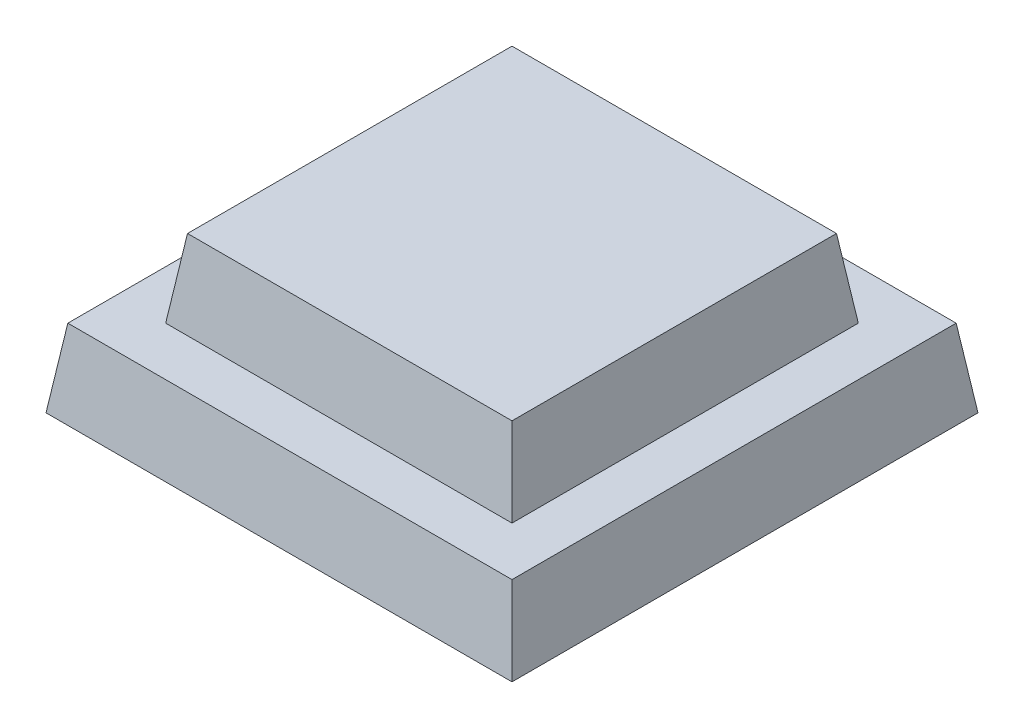
ISO-10303-21;
HEADER;
FILE_DESCRIPTION(('STEP AP214'),'2;1');
FILE_NAME('part.step','',(''),(''),'','','');
FILE_SCHEMA(('AUTOMOTIVE_DESIGN { 1 0 10303 214 1 1 1 1 }'));
ENDSEC;
DATA;
#1=APPLICATION_CONTEXT('core data for automotive mechanical design processes');
#2=APPLICATION_PROTOCOL_DEFINITION('international standard','automotive_design',2000,#1);
#3=PRODUCT_CONTEXT('',#1,'mechanical');
#4=PRODUCT('Part','Part','',(#3));
#5=PRODUCT_RELATED_PRODUCT_CATEGORY('part','',(#4));
#6=PRODUCT_DEFINITION_FORMATION('','',#4);
#7=PRODUCT_DEFINITION_CONTEXT('part definition',#1,'design');
#8=PRODUCT_DEFINITION('design','',#6,#7);
#9=PRODUCT_DEFINITION_SHAPE('','',#8);
#10=(LENGTH_UNIT() NAMED_UNIT(*) SI_UNIT(.MILLI.,.METRE.));
#11=(NAMED_UNIT(*) PLANE_ANGLE_UNIT() SI_UNIT($,.RADIAN.));
#12=(NAMED_UNIT(*) SI_UNIT($,.STERADIAN.) SOLID_ANGLE_UNIT());
#13=UNCERTAINTY_MEASURE_WITH_UNIT(LENGTH_MEASURE(1.E-05),#10,'distance_accuracy_value','');
#14=(GEOMETRIC_REPRESENTATION_CONTEXT(3) GLOBAL_UNCERTAINTY_ASSIGNED_CONTEXT((#13)) GLOBAL_UNIT_ASSIGNED_CONTEXT((#10,
#11,#12)) REPRESENTATION_CONTEXT('',''));
#15=CARTESIAN_POINT('',(0.,0.,0.));
#16=DIRECTION('',(0.,0.,1.));
#17=DIRECTION('',(1.,0.,0.));
#18=AXIS2_PLACEMENT_3D('',#15,#16,#17);
#19=CARTESIAN_POINT('',(0.,3.175,0.));
#20=DIRECTION('',(0.,1.,0.));
#21=DIRECTION('',(0.,0.,1.));
#22=AXIS2_PLACEMENT_3D('',#19,#20,#21);
#23=PLANE('',#22);
#24=DIRECTION('',(0.,0.,1.));
#25=VECTOR('',#24,1.);
#26=CARTESIAN_POINT('',(9.07878284981991,3.175,-9.525));
#27=LINE('',#26,#25);
#28=CARTESIAN_POINT('',(9.07878284981991,3.175,9.0787828498199));
#29=VERTEX_POINT('',#28);
#30=CARTESIAN_POINT('',(9.07878284981991,3.175,-9.0787828498199));
#31=VERTEX_POINT('',#30);
#32=EDGE_CURVE('E147',#29,#31,#27,.F.);
#33=ORIENTED_EDGE('',*,*,#32,.T.);
#34=DIRECTION('',(1.,0.,0.));
#35=VECTOR('',#34,1.);
#36=CARTESIAN_POINT('',(-9.525,3.175,-9.0787828498199));
#37=LINE('',#36,#35);
#38=CARTESIAN_POINT('',(-9.07878284981991,3.175,-9.0787828498199));
#39=VERTEX_POINT('',#38);
#40=EDGE_CURVE('E158',#31,#39,#37,.F.);
#41=ORIENTED_EDGE('',*,*,#40,.T.);
#42=DIRECTION('',(0.,0.,-1.));
#43=VECTOR('',#42,1.);
#44=CARTESIAN_POINT('',(-9.07878284981991,3.175,-9.525));
#45=LINE('',#44,#43);
#46=CARTESIAN_POINT('',(-9.07878284981991,3.175,9.0787828498199));
#47=VERTEX_POINT('',#46);
#48=EDGE_CURVE('E159',#39,#47,#45,.F.);
#49=ORIENTED_EDGE('',*,*,#48,.T.);
#50=DIRECTION('',(-1.,0.,0.));
#51=VECTOR('',#50,1.);
#52=CARTESIAN_POINT('',(-9.525,3.175,9.0787828498199));
#53=LINE('',#52,#51);
#54=EDGE_CURVE('E37',#47,#29,#53,.F.);
#55=ORIENTED_EDGE('',*,*,#54,.T.);
#56=EDGE_LOOP('',(#33,#41,#49,#55));
#57=FACE_BOUND('',#56,.T.);
#58=DIRECTION('',(1.,0.,0.));
#59=VECTOR('',#58,1.);
#60=CARTESIAN_POINT('',(-7.07878284981991,3.175,7.0787828498199));
#61=LINE('',#60,#59);
#62=CARTESIAN_POINT('',(-7.07878284981991,3.175,7.0787828498199));
#63=VERTEX_POINT('',#62);
#64=CARTESIAN_POINT('',(7.07878284981991,3.175,7.0787828498199));
#65=VERTEX_POINT('',#64);
#66=EDGE_CURVE('E105',#63,#65,#61,.T.);
#67=ORIENTED_EDGE('',*,*,#66,.F.);
#68=DIRECTION('',(0.,0.,1.));
#69=VECTOR('',#68,1.);
#70=CARTESIAN_POINT('',(-7.07878284981991,3.175,-7.0787828498199));
#71=LINE('',#70,#69);
#72=CARTESIAN_POINT('',(-7.07878284981991,3.175,-7.0787828498199));
#73=VERTEX_POINT('',#72);
#74=EDGE_CURVE('E116',#73,#63,#71,.T.);
#75=ORIENTED_EDGE('',*,*,#74,.F.);
#76=DIRECTION('',(-1.,0.,0.));
#77=VECTOR('',#76,1.);
#78=CARTESIAN_POINT('',(7.07878284981991,3.175,-7.0787828498199));
#79=LINE('',#78,#77);
#80=CARTESIAN_POINT('',(7.07878284981991,3.175,-7.0787828498199));
#81=VERTEX_POINT('',#80);
#82=EDGE_CURVE('E126',#81,#73,#79,.T.);
#83=ORIENTED_EDGE('',*,*,#82,.F.);
#84=DIRECTION('',(0.,0.,-1.));
#85=VECTOR('',#84,1.);
#86=CARTESIAN_POINT('',(7.07878284981991,3.175,7.0787828498199));
#87=LINE('',#86,#85);
#88=EDGE_CURVE('E124',#65,#81,#87,.T.);
#89=ORIENTED_EDGE('',*,*,#88,.F.);
#90=EDGE_LOOP('',(#67,#75,#83,#89));
#91=FACE_BOUND('',#90,.T.);
#92=ADVANCED_FACE('F33',(#57,#91),#23,.T.);
#93=CARTESIAN_POINT('',(9.525,0.,-9.525));
#94=DIRECTION('',(0.99026806874157,0.139173100960066,0.));
#95=DIRECTION('',(-0.139173100960066,0.99026806874157,0.));
#96=AXIS2_PLACEMENT_3D('',#93,#94,#95);
#97=PLANE('',#96);
#98=DIRECTION('',(0.,0.,-1.));
#99=VECTOR('',#98,1.);
#100=CARTESIAN_POINT('',(9.525,0.,-9.525));
#101=LINE('',#100,#99);
#102=CARTESIAN_POINT('',(9.525,0.,9.525));
#103=VERTEX_POINT('',#102);
#104=CARTESIAN_POINT('',(9.525,0.,-9.525));
#105=VERTEX_POINT('',#104);
#106=EDGE_CURVE('E111',#103,#105,#101,.T.);
#107=ORIENTED_EDGE('',*,*,#106,.T.);
#108=DIRECTION('',(0.137844537491629,-0.980814848463989,-0.137844537491629));
#109=VECTOR('',#108,1.);
#110=CARTESIAN_POINT('',(9.16302873036485,2.57555941233494,-9.16302873036484));
#111=LINE('',#110,#109);
#112=EDGE_CURVE('E11',#31,#105,#111,.T.);
#113=ORIENTED_EDGE('',*,*,#112,.F.);
#114=ORIENTED_EDGE('',*,*,#32,.F.);
#115=DIRECTION('',(0.137844537491629,-0.980814848463989,0.137844537491629));
#116=VECTOR('',#115,1.);
#117=CARTESIAN_POINT('',(9.16302873036484,2.57555941233494,9.16302873036484));
#118=LINE('',#117,#116);
#119=EDGE_CURVE('E149',#29,#103,#118,.T.);
#120=ORIENTED_EDGE('',*,*,#119,.T.);
#121=EDGE_LOOP('',(#107,#113,#114,#120));
#122=FACE_BOUND('',#121,.T.);
#123=ADVANCED_FACE('F173',(#122),#97,.T.);
#124=CARTESIAN_POINT('',(-9.525,0.,-9.525));
#125=DIRECTION('',(0.,0.139173100960066,-0.99026806874157));
#126=DIRECTION('',(0.,0.99026806874157,0.139173100960066));
#127=AXIS2_PLACEMENT_3D('',#124,#125,#126);
#128=PLANE('',#127);
#129=DIRECTION('',(-1.,0.,0.));
#130=VECTOR('',#129,1.);
#131=CARTESIAN_POINT('',(-9.525,0.,-9.525));
#132=LINE('',#131,#130);
#133=CARTESIAN_POINT('',(-9.525,0.,-9.525));
#134=VERTEX_POINT('',#133);
#135=EDGE_CURVE('E142',#105,#134,#132,.T.);
#136=ORIENTED_EDGE('',*,*,#135,.T.);
#137=DIRECTION('',(-0.137844537491629,-0.980814848463989,-0.137844537491629));
#138=VECTOR('',#137,1.);
#139=CARTESIAN_POINT('',(-9.525,0.,-9.525));
#140=LINE('',#139,#138);
#141=EDGE_CURVE('E42',#39,#134,#140,.T.);
#142=ORIENTED_EDGE('',*,*,#141,.F.);
#143=ORIENTED_EDGE('',*,*,#40,.F.);
#144=ORIENTED_EDGE('',*,*,#112,.T.);
#145=EDGE_LOOP('',(#136,#142,#143,#144));
#146=FACE_BOUND('',#145,.T.);
#147=ADVANCED_FACE('F35',(#146),#128,.T.);
#148=CARTESIAN_POINT('',(-9.525,0.,-9.525));
#149=DIRECTION('',(-0.99026806874157,0.139173100960066,0.));
#150=DIRECTION('',(-0.139173100960066,-0.99026806874157,0.));
#151=AXIS2_PLACEMENT_3D('',#148,#149,#150);
#152=PLANE('',#151);
#153=DIRECTION('',(0.,0.,1.));
#154=VECTOR('',#153,1.);
#155=CARTESIAN_POINT('',(-9.525,0.,-9.525));
#156=LINE('',#155,#154);
#157=CARTESIAN_POINT('',(-9.525,0.,9.525));
#158=VERTEX_POINT('',#157);
#159=EDGE_CURVE('E144',#134,#158,#156,.T.);
#160=ORIENTED_EDGE('',*,*,#159,.T.);
#161=DIRECTION('',(-0.137844537491629,-0.980814848463989,0.137844537491629));
#162=VECTOR('',#161,1.);
#163=CARTESIAN_POINT('',(-9.525,0.,9.525));
#164=LINE('',#163,#162);
#165=EDGE_CURVE('E152',#47,#158,#164,.T.);
#166=ORIENTED_EDGE('',*,*,#165,.F.);
#167=ORIENTED_EDGE('',*,*,#48,.F.);
#168=ORIENTED_EDGE('',*,*,#141,.T.);
#169=EDGE_LOOP('',(#160,#166,#167,#168));
#170=FACE_BOUND('',#169,.T.);
#171=ADVANCED_FACE('F164',(#170),#152,.T.);
#172=CARTESIAN_POINT('',(-9.525,0.,9.525));
#173=DIRECTION('',(0.,0.139173100960066,0.99026806874157));
#174=DIRECTION('',(0.,-0.99026806874157,0.139173100960066));
#175=AXIS2_PLACEMENT_3D('',#172,#173,#174);
#176=PLANE('',#175);
#177=DIRECTION('',(1.,0.,0.));
#178=VECTOR('',#177,1.);
#179=CARTESIAN_POINT('',(-9.525,0.,9.525));
#180=LINE('',#179,#178);
#181=EDGE_CURVE('E146',#158,#103,#180,.T.);
#182=ORIENTED_EDGE('',*,*,#181,.T.);
#183=ORIENTED_EDGE('',*,*,#119,.F.);
#184=ORIENTED_EDGE('',*,*,#54,.F.);
#185=ORIENTED_EDGE('',*,*,#165,.T.);
#186=EDGE_LOOP('',(#182,#183,#184,#185));
#187=FACE_BOUND('',#186,.T.);
#188=ADVANCED_FACE('F168',(#187),#176,.T.);
#189=CARTESIAN_POINT('',(0.,0.,0.));
#190=DIRECTION('',(0.,1.,0.));
#191=DIRECTION('',(0.,0.,1.));
#192=AXIS2_PLACEMENT_3D('',#189,#190,#191);
#193=PLANE('',#192);
#194=ORIENTED_EDGE('',*,*,#106,.F.);
#195=ORIENTED_EDGE('',*,*,#181,.F.);
#196=ORIENTED_EDGE('',*,*,#159,.F.);
#197=ORIENTED_EDGE('',*,*,#135,.F.);
#198=EDGE_LOOP('',(#194,#195,#196,#197));
#199=FACE_BOUND('',#198,.T.);
#200=ADVANCED_FACE('F176',(#199),#193,.F.);
#201=CARTESIAN_POINT('',(-7.07878284981991,3.175,-7.0787828498199));
#202=DIRECTION('',(-0.99026806874157,0.139173100960066,0.));
#203=DIRECTION('',(-0.139173100960066,-0.99026806874157,0.));
#204=AXIS2_PLACEMENT_3D('',#201,#202,#203);
#205=PLANE('',#204);
#206=ORIENTED_EDGE('',*,*,#74,.T.);
#207=DIRECTION('',(-0.137844537491629,-0.980814848463989,0.137844537491629));
#208=VECTOR('',#207,1.);
#209=CARTESIAN_POINT('',(-7.07878284981991,3.175,7.0787828498199));
#210=LINE('',#209,#208);
#211=CARTESIAN_POINT('',(-6.63256569963981,6.35,6.63256569963981));
#212=VERTEX_POINT('',#211);
#213=EDGE_CURVE('E100',#212,#63,#210,.T.);
#214=ORIENTED_EDGE('',*,*,#213,.F.);
#215=DIRECTION('',(0.,0.,-1.));
#216=VECTOR('',#215,1.);
#217=CARTESIAN_POINT('',(-6.63256569963981,6.35,-7.0787828498199));
#218=LINE('',#217,#216);
#219=CARTESIAN_POINT('',(-6.63256569963981,6.35,-6.63256569963981));
#220=VERTEX_POINT('',#219);
#221=EDGE_CURVE('E129',#220,#212,#218,.F.);
#222=ORIENTED_EDGE('',*,*,#221,.F.);
#223=DIRECTION('',(-0.137844537491629,-0.980814848463989,-0.137844537491629));
#224=VECTOR('',#223,1.);
#225=CARTESIAN_POINT('',(-7.07878284981991,3.175,-7.0787828498199));
#226=LINE('',#225,#224);
#227=EDGE_CURVE('E119',#220,#73,#226,.T.);
#228=ORIENTED_EDGE('',*,*,#227,.T.);
#229=EDGE_LOOP('',(#206,#214,#222,#228));
#230=FACE_BOUND('',#229,.T.);
#231=ADVANCED_FACE('F117',(#230),#205,.T.);
#232=CARTESIAN_POINT('',(-7.07878284981991,3.175,7.0787828498199));
#233=DIRECTION('',(0.,0.139173100960066,0.99026806874157));
#234=DIRECTION('',(0.,-0.99026806874157,0.139173100960066));
#235=AXIS2_PLACEMENT_3D('',#232,#233,#234);
#236=PLANE('',#235);
#237=ORIENTED_EDGE('',*,*,#66,.T.);
#238=DIRECTION('',(0.137844537491629,-0.980814848463989,0.137844537491629));
#239=VECTOR('',#238,1.);
#240=CARTESIAN_POINT('',(7.07878284981991,3.175,7.0787828498199));
#241=LINE('',#240,#239);
#242=CARTESIAN_POINT('',(6.63256569963981,6.35,6.63256569963981));
#243=VERTEX_POINT('',#242);
#244=EDGE_CURVE('E112',#243,#65,#241,.T.);
#245=ORIENTED_EDGE('',*,*,#244,.F.);
#246=DIRECTION('',(-1.,0.,0.));
#247=VECTOR('',#246,1.);
#248=CARTESIAN_POINT('',(-7.07878284981991,6.35,6.63256569963981));
#249=LINE('',#248,#247);
#250=EDGE_CURVE('E107',#212,#243,#249,.F.);
#251=ORIENTED_EDGE('',*,*,#250,.F.);
#252=ORIENTED_EDGE('',*,*,#213,.T.);
#253=EDGE_LOOP('',(#237,#245,#251,#252));
#254=FACE_BOUND('',#253,.T.);
#255=ADVANCED_FACE('F102',(#254),#236,.T.);
#256=CARTESIAN_POINT('',(7.07878284981991,3.175,7.0787828498199));
#257=DIRECTION('',(0.99026806874157,0.139173100960066,0.));
#258=DIRECTION('',(-0.139173100960066,0.99026806874157,0.));
#259=AXIS2_PLACEMENT_3D('',#256,#257,#258);
#260=PLANE('',#259);
#261=ORIENTED_EDGE('',*,*,#88,.T.);
#262=DIRECTION('',(0.137844537491629,-0.980814848463989,-0.137844537491629));
#263=VECTOR('',#262,1.);
#264=CARTESIAN_POINT('',(7.07878284981991,3.175,-7.0787828498199));
#265=LINE('',#264,#263);
#266=CARTESIAN_POINT('',(6.63256569963981,6.35,-6.63256569963981));
#267=VERTEX_POINT('',#266);
#268=EDGE_CURVE('E50',#267,#81,#265,.T.);
#269=ORIENTED_EDGE('',*,*,#268,.F.);
#270=DIRECTION('',(0.,0.,1.));
#271=VECTOR('',#270,1.);
#272=CARTESIAN_POINT('',(6.63256569963981,6.35,7.0787828498199));
#273=LINE('',#272,#271);
#274=EDGE_CURVE('E137',#243,#267,#273,.F.);
#275=ORIENTED_EDGE('',*,*,#274,.F.);
#276=ORIENTED_EDGE('',*,*,#244,.T.);
#277=EDGE_LOOP('',(#261,#269,#275,#276));
#278=FACE_BOUND('',#277,.T.);
#279=ADVANCED_FACE('F194',(#278),#260,.T.);
#280=CARTESIAN_POINT('',(7.07878284981991,3.175,-7.0787828498199));
#281=DIRECTION('',(0.,0.139173100960066,-0.99026806874157));
#282=DIRECTION('',(0.,0.99026806874157,0.139173100960066));
#283=AXIS2_PLACEMENT_3D('',#280,#281,#282);
#284=PLANE('',#283);
#285=ORIENTED_EDGE('',*,*,#82,.T.);
#286=ORIENTED_EDGE('',*,*,#227,.F.);
#287=DIRECTION('',(1.,0.,0.));
#288=VECTOR('',#287,1.);
#289=CARTESIAN_POINT('',(7.07878284981991,6.35,-6.63256569963981));
#290=LINE('',#289,#288);
#291=EDGE_CURVE('E132',#267,#220,#290,.F.);
#292=ORIENTED_EDGE('',*,*,#291,.F.);
#293=ORIENTED_EDGE('',*,*,#268,.T.);
#294=EDGE_LOOP('',(#285,#286,#292,#293));
#295=FACE_BOUND('',#294,.T.);
#296=ADVANCED_FACE('F197',(#295),#284,.T.);
#297=CARTESIAN_POINT('',(0.,6.35,0.));
#298=DIRECTION('',(0.,1.,0.));
#299=DIRECTION('',(0.,0.,1.));
#300=AXIS2_PLACEMENT_3D('',#297,#298,#299);
#301=PLANE('',#300);
#302=ORIENTED_EDGE('',*,*,#221,.T.);
#303=ORIENTED_EDGE('',*,*,#250,.T.);
#304=ORIENTED_EDGE('',*,*,#274,.T.);
#305=ORIENTED_EDGE('',*,*,#291,.T.);
#306=EDGE_LOOP('',(#302,#303,#304,#305));
#307=FACE_BOUND('',#306,.T.);
#308=ADVANCED_FACE('F200',(#307),#301,.T.);
#309=CLOSED_SHELL('',(#92,#123,#147,#171,#188,#200,#231,#255,#279,#296,#308));
#310=MANIFOLD_SOLID_BREP('B2',#309);
#311=ADVANCED_BREP_SHAPE_REPRESENTATION('',(#18,#310),#14);
#312=SHAPE_DEFINITION_REPRESENTATION(#9,#311);
ENDSEC;
END-ISO-10303-21;
